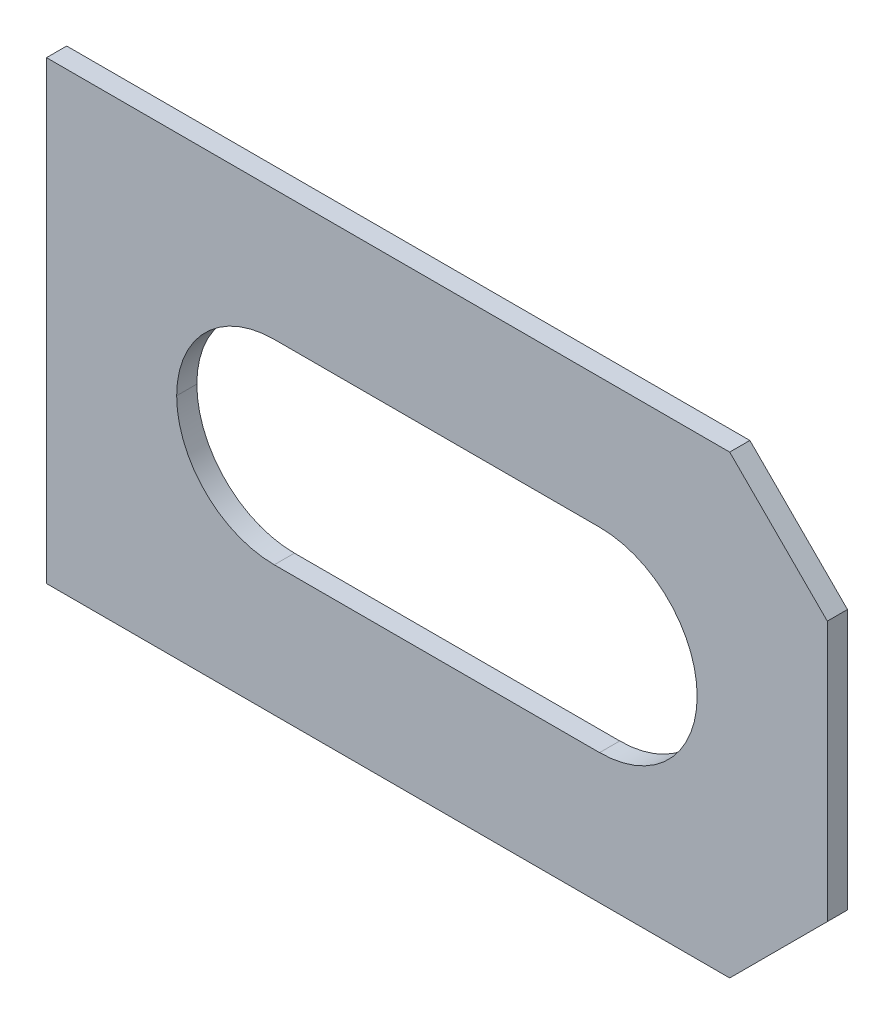
ISO-10303-21;
HEADER;
FILE_DESCRIPTION(('STEP AP214'),'2;1');
FILE_NAME('part.step','',(''),(''),'','','');
FILE_SCHEMA(('AUTOMOTIVE_DESIGN { 1 0 10303 214 1 1 1 1 }'));
ENDSEC;
DATA;
#1=APPLICATION_CONTEXT('core data for automotive mechanical design processes');
#2=APPLICATION_PROTOCOL_DEFINITION('international standard','automotive_design',2000,#1);
#3=PRODUCT_CONTEXT('',#1,'mechanical');
#4=PRODUCT('Part','Part','',(#3));
#5=PRODUCT_RELATED_PRODUCT_CATEGORY('part','',(#4));
#6=PRODUCT_DEFINITION_FORMATION('','',#4);
#7=PRODUCT_DEFINITION_CONTEXT('part definition',#1,'design');
#8=PRODUCT_DEFINITION('design','',#6,#7);
#9=PRODUCT_DEFINITION_SHAPE('','',#8);
#10=(LENGTH_UNIT() NAMED_UNIT(*) SI_UNIT(.MILLI.,.METRE.));
#11=(NAMED_UNIT(*) PLANE_ANGLE_UNIT() SI_UNIT($,.RADIAN.));
#12=(NAMED_UNIT(*) SI_UNIT($,.STERADIAN.) SOLID_ANGLE_UNIT());
#13=UNCERTAINTY_MEASURE_WITH_UNIT(LENGTH_MEASURE(1.E-05),#10,'distance_accuracy_value','');
#14=(GEOMETRIC_REPRESENTATION_CONTEXT(3) GLOBAL_UNCERTAINTY_ASSIGNED_CONTEXT((#13)) GLOBAL_UNIT_ASSIGNED_CONTEXT((#10,
#11,#12)) REPRESENTATION_CONTEXT('',''));
#15=CARTESIAN_POINT('',(0.,0.,0.));
#16=DIRECTION('',(0.,0.,1.));
#17=DIRECTION('',(1.,0.,0.));
#18=AXIS2_PLACEMENT_3D('',#15,#16,#17);
#19=CARTESIAN_POINT('',(0.,0.,3.1));
#20=DIRECTION('',(0.,0.,-1.));
#21=DIRECTION('',(-1.,0.,0.));
#22=AXIS2_PLACEMENT_3D('',#19,#20,#21);
#23=PLANE('',#22);
#24=DIRECTION('',(1.,0.,0.));
#25=VECTOR('',#24,1.);
#26=CARTESIAN_POINT('',(-60.,-35.,3.1));
#27=LINE('',#26,#25);
#28=CARTESIAN_POINT('',(-60.,-35.,3.1));
#29=VERTEX_POINT('',#28);
#30=CARTESIAN_POINT('',(44.9999999999999,-35.,3.1));
#31=VERTEX_POINT('',#30);
#32=EDGE_CURVE('E144',#29,#31,#27,.T.);
#33=ORIENTED_EDGE('',*,*,#32,.T.);
#34=DIRECTION('',(-0.707106781186549,-0.707106781186546,0.));
#35=VECTOR('',#34,1.);
#36=CARTESIAN_POINT('',(60.,-20.,3.1));
#37=LINE('',#36,#35);
#38=CARTESIAN_POINT('',(60.,-20.,3.1));
#39=VERTEX_POINT('',#38);
#40=EDGE_CURVE('E41',#31,#39,#37,.F.);
#41=ORIENTED_EDGE('',*,*,#40,.T.);
#42=DIRECTION('',(0.,1.,0.));
#43=VECTOR('',#42,1.);
#44=CARTESIAN_POINT('',(60.,-35.,3.1));
#45=LINE('',#44,#43);
#46=CARTESIAN_POINT('',(60.,20.,3.1));
#47=VERTEX_POINT('',#46);
#48=EDGE_CURVE('E130',#39,#47,#45,.T.);
#49=ORIENTED_EDGE('',*,*,#48,.T.);
#50=DIRECTION('',(0.707106781186546,-0.707106781186549,0.));
#51=VECTOR('',#50,1.);
#52=CARTESIAN_POINT('',(45.,35.,3.1));
#53=LINE('',#52,#51);
#54=CARTESIAN_POINT('',(45.,35.,3.1));
#55=VERTEX_POINT('',#54);
#56=EDGE_CURVE('E48',#47,#55,#53,.F.);
#57=ORIENTED_EDGE('',*,*,#56,.T.);
#58=DIRECTION('',(-1.,0.,0.));
#59=VECTOR('',#58,1.);
#60=CARTESIAN_POINT('',(-60.,35.,3.1));
#61=LINE('',#60,#59);
#62=CARTESIAN_POINT('',(-60.,35.,3.1));
#63=VERTEX_POINT('',#62);
#64=EDGE_CURVE('E122',#55,#63,#61,.T.);
#65=ORIENTED_EDGE('',*,*,#64,.T.);
#66=DIRECTION('',(0.,-1.,0.));
#67=VECTOR('',#66,1.);
#68=CARTESIAN_POINT('',(-60.,-35.,3.1));
#69=LINE('',#68,#67);
#70=EDGE_CURVE('E126',#63,#29,#69,.T.);
#71=ORIENTED_EDGE('',*,*,#70,.T.);
#72=EDGE_LOOP('',(#33,#41,#49,#57,#65,#71));
#73=FACE_BOUND('',#72,.T.);
#74=DIRECTION('',(-1.,0.,0.));
#75=VECTOR('',#74,1.);
#76=CARTESIAN_POINT('',(-40.,15.,3.1));
#77=LINE('',#76,#75);
#78=CARTESIAN_POINT('',(25.,15.,3.1));
#79=VERTEX_POINT('',#78);
#80=CARTESIAN_POINT('',(-25.,15.,3.1));
#81=VERTEX_POINT('',#80);
#82=EDGE_CURVE('E252',#79,#81,#77,.T.);
#83=ORIENTED_EDGE('',*,*,#82,.F.);
#84=CARTESIAN_POINT('',(25.,0.,3.1));
#85=DIRECTION('',(0.,0.,-1.));
#86=DIRECTION('',(-1.,0.,0.));
#87=AXIS2_PLACEMENT_3D('',#84,#85,#86);
#88=CIRCLE('',#87,15.);
#89=CARTESIAN_POINT('',(40.,0.,3.1));
#90=VERTEX_POINT('',#89);
#91=EDGE_CURVE('E174',#79,#90,#88,.T.);
#92=ORIENTED_EDGE('',*,*,#91,.T.);
#93=CARTESIAN_POINT('',(25.,0.,3.1));
#94=DIRECTION('',(0.,0.,-1.));
#95=DIRECTION('',(-1.,0.,0.));
#96=AXIS2_PLACEMENT_3D('',#93,#94,#95);
#97=CIRCLE('',#96,15.);
#98=CARTESIAN_POINT('',(25.,-15.,3.1));
#99=VERTEX_POINT('',#98);
#100=EDGE_CURVE('E170',#90,#99,#97,.T.);
#101=ORIENTED_EDGE('',*,*,#100,.T.);
#102=DIRECTION('',(1.,0.,0.));
#103=VECTOR('',#102,1.);
#104=CARTESIAN_POINT('',(-40.,-15.,3.1));
#105=LINE('',#104,#103);
#106=CARTESIAN_POINT('',(-25.,-15.,3.1));
#107=VERTEX_POINT('',#106);
#108=EDGE_CURVE('E152',#107,#99,#105,.T.);
#109=ORIENTED_EDGE('',*,*,#108,.F.);
#110=CARTESIAN_POINT('',(-25.,0.,3.1));
#111=DIRECTION('',(0.,0.,-1.));
#112=DIRECTION('',(-1.,0.,0.));
#113=AXIS2_PLACEMENT_3D('',#110,#111,#112);
#114=CIRCLE('',#113,15.);
#115=CARTESIAN_POINT('',(-40.,0.,3.1));
#116=VERTEX_POINT('',#115);
#117=EDGE_CURVE('E182',#107,#116,#114,.T.);
#118=ORIENTED_EDGE('',*,*,#117,.T.);
#119=CARTESIAN_POINT('',(-25.,0.,3.1));
#120=DIRECTION('',(0.,0.,-1.));
#121=DIRECTION('',(-1.,0.,0.));
#122=AXIS2_PLACEMENT_3D('',#119,#120,#121);
#123=CIRCLE('',#122,15.);
#124=EDGE_CURVE('E178',#116,#81,#123,.T.);
#125=ORIENTED_EDGE('',*,*,#124,.T.);
#126=EDGE_LOOP('',(#83,#92,#101,#109,#118,#125));
#127=FACE_BOUND('',#126,.T.);
#128=ADVANCED_FACE('F33',(#73,#127),#23,.F.);
#129=CARTESIAN_POINT('',(0.,0.,0.));
#130=DIRECTION('',(0.,0.,-1.));
#131=DIRECTION('',(-1.,0.,0.));
#132=AXIS2_PLACEMENT_3D('',#129,#130,#131);
#133=PLANE('',#132);
#134=DIRECTION('',(0.,1.,0.));
#135=VECTOR('',#134,1.);
#136=CARTESIAN_POINT('',(60.,-35.,0.));
#137=LINE('',#136,#135);
#138=CARTESIAN_POINT('',(60.,-20.,0.));
#139=VERTEX_POINT('',#138);
#140=CARTESIAN_POINT('',(60.,19.9999999999999,0.));
#141=VERTEX_POINT('',#140);
#142=EDGE_CURVE('E149',#139,#141,#137,.T.);
#143=ORIENTED_EDGE('',*,*,#142,.F.);
#144=DIRECTION('',(0.707106781186549,0.707106781186546,0.));
#145=VECTOR('',#144,1.);
#146=CARTESIAN_POINT('',(39.9999999999999,-40.,0.));
#147=LINE('',#146,#145);
#148=CARTESIAN_POINT('',(45.,-35.,0.));
#149=VERTEX_POINT('',#148);
#150=EDGE_CURVE('E198',#139,#149,#147,.F.);
#151=ORIENTED_EDGE('',*,*,#150,.T.);
#152=DIRECTION('',(1.,0.,0.));
#153=VECTOR('',#152,1.);
#154=CARTESIAN_POINT('',(-60.,-35.,0.));
#155=LINE('',#154,#153);
#156=CARTESIAN_POINT('',(-60.,-35.,0.));
#157=VERTEX_POINT('',#156);
#158=EDGE_CURVE('E156',#157,#149,#155,.T.);
#159=ORIENTED_EDGE('',*,*,#158,.F.);
#160=DIRECTION('',(0.,-1.,0.));
#161=VECTOR('',#160,1.);
#162=CARTESIAN_POINT('',(-60.,-35.,0.));
#163=LINE('',#162,#161);
#164=CARTESIAN_POINT('',(-60.,35.,0.));
#165=VERTEX_POINT('',#164);
#166=EDGE_CURVE('E154',#165,#157,#163,.T.);
#167=ORIENTED_EDGE('',*,*,#166,.F.);
#168=DIRECTION('',(-1.,0.,0.));
#169=VECTOR('',#168,1.);
#170=CARTESIAN_POINT('',(-60.,35.,0.));
#171=LINE('',#170,#169);
#172=CARTESIAN_POINT('',(45.,35.,0.));
#173=VERTEX_POINT('',#172);
#174=EDGE_CURVE('E136',#173,#165,#171,.T.);
#175=ORIENTED_EDGE('',*,*,#174,.F.);
#176=DIRECTION('',(-0.707106781186546,0.707106781186549,0.));
#177=VECTOR('',#176,1.);
#178=CARTESIAN_POINT('',(40.0000000000001,39.9999999999999,0.));
#179=LINE('',#178,#177);
#180=EDGE_CURVE('E196',#173,#141,#179,.F.);
#181=ORIENTED_EDGE('',*,*,#180,.T.);
#182=EDGE_LOOP('',(#143,#151,#159,#167,#175,#181));
#183=FACE_BOUND('',#182,.T.);
#184=CARTESIAN_POINT('',(-25.,0.,0.));
#185=DIRECTION('',(0.,0.,-1.));
#186=DIRECTION('',(-1.,0.,0.));
#187=AXIS2_PLACEMENT_3D('',#184,#185,#186);
#188=CIRCLE('',#187,15.);
#189=CARTESIAN_POINT('',(-25.,15.,0.));
#190=VERTEX_POINT('',#189);
#191=CARTESIAN_POINT('',(-40.,0.,0.));
#192=VERTEX_POINT('',#191);
#193=EDGE_CURVE('E176',#190,#192,#188,.F.);
#194=ORIENTED_EDGE('',*,*,#193,.T.);
#195=CARTESIAN_POINT('',(-25.,0.,0.));
#196=DIRECTION('',(0.,0.,-1.));
#197=DIRECTION('',(-1.,0.,0.));
#198=AXIS2_PLACEMENT_3D('',#195,#196,#197);
#199=CIRCLE('',#198,15.);
#200=CARTESIAN_POINT('',(-25.,-15.,0.));
#201=VERTEX_POINT('',#200);
#202=EDGE_CURVE('E180',#192,#201,#199,.F.);
#203=ORIENTED_EDGE('',*,*,#202,.T.);
#204=DIRECTION('',(1.,0.,0.));
#205=VECTOR('',#204,1.);
#206=CARTESIAN_POINT('',(-40.,-15.,0.));
#207=LINE('',#206,#205);
#208=CARTESIAN_POINT('',(25.,-15.,0.));
#209=VERTEX_POINT('',#208);
#210=EDGE_CURVE('E260',#201,#209,#207,.T.);
#211=ORIENTED_EDGE('',*,*,#210,.T.);
#212=CARTESIAN_POINT('',(25.,0.,0.));
#213=DIRECTION('',(0.,0.,-1.));
#214=DIRECTION('',(-1.,0.,0.));
#215=AXIS2_PLACEMENT_3D('',#212,#213,#214);
#216=CIRCLE('',#215,15.);
#217=CARTESIAN_POINT('',(40.,0.,0.));
#218=VERTEX_POINT('',#217);
#219=EDGE_CURVE('E168',#209,#218,#216,.F.);
#220=ORIENTED_EDGE('',*,*,#219,.T.);
#221=CARTESIAN_POINT('',(25.,0.,0.));
#222=DIRECTION('',(0.,0.,-1.));
#223=DIRECTION('',(-1.,0.,0.));
#224=AXIS2_PLACEMENT_3D('',#221,#222,#223);
#225=CIRCLE('',#224,15.);
#226=CARTESIAN_POINT('',(25.,15.,0.));
#227=VERTEX_POINT('',#226);
#228=EDGE_CURVE('E172',#218,#227,#225,.F.);
#229=ORIENTED_EDGE('',*,*,#228,.T.);
#230=DIRECTION('',(-1.,0.,0.));
#231=VECTOR('',#230,1.);
#232=CARTESIAN_POINT('',(-40.,15.,0.));
#233=LINE('',#232,#231);
#234=EDGE_CURVE('E188',#227,#190,#233,.T.);
#235=ORIENTED_EDGE('',*,*,#234,.T.);
#236=EDGE_LOOP('',(#194,#203,#211,#220,#229,#235));
#237=FACE_BOUND('',#236,.T.);
#238=ADVANCED_FACE('F212',(#183,#237),#133,.T.);
#239=CARTESIAN_POINT('',(60.,-35.,3.1));
#240=DIRECTION('',(-1.,0.,0.));
#241=DIRECTION('',(0.,0.,1.));
#242=AXIS2_PLACEMENT_3D('',#239,#240,#241);
#243=PLANE('',#242);
#244=ORIENTED_EDGE('',*,*,#48,.F.);
#245=DIRECTION('',(0.,0.,-1.));
#246=VECTOR('',#245,1.);
#247=CARTESIAN_POINT('',(60.,-20.,3.1));
#248=LINE('',#247,#246);
#249=EDGE_CURVE('E193',#39,#139,#248,.T.);
#250=ORIENTED_EDGE('',*,*,#249,.T.);
#251=ORIENTED_EDGE('',*,*,#142,.T.);
#252=DIRECTION('',(0.,0.,1.));
#253=VECTOR('',#252,1.);
#254=CARTESIAN_POINT('',(60.,19.9999999999999,3.1));
#255=LINE('',#254,#253);
#256=EDGE_CURVE('E184',#141,#47,#255,.T.);
#257=ORIENTED_EDGE('',*,*,#256,.T.);
#258=EDGE_LOOP('',(#244,#250,#251,#257));
#259=FACE_BOUND('',#258,.T.);
#260=ADVANCED_FACE('F206',(#259),#243,.F.);
#261=CARTESIAN_POINT('',(-60.,35.,3.1));
#262=DIRECTION('',(0.,-1.,0.));
#263=DIRECTION('',(0.,0.,-1.));
#264=AXIS2_PLACEMENT_3D('',#261,#262,#263);
#265=PLANE('',#264);
#266=ORIENTED_EDGE('',*,*,#64,.F.);
#267=DIRECTION('',(0.,0.,-1.));
#268=VECTOR('',#267,1.);
#269=CARTESIAN_POINT('',(45.,35.,3.1));
#270=LINE('',#269,#268);
#271=EDGE_CURVE('E11',#55,#173,#270,.T.);
#272=ORIENTED_EDGE('',*,*,#271,.T.);
#273=ORIENTED_EDGE('',*,*,#174,.T.);
#274=DIRECTION('',(0.,0.,-1.));
#275=VECTOR('',#274,1.);
#276=CARTESIAN_POINT('',(-60.,35.,3.1));
#277=LINE('',#276,#275);
#278=EDGE_CURVE('E133',#63,#165,#277,.T.);
#279=ORIENTED_EDGE('',*,*,#278,.F.);
#280=EDGE_LOOP('',(#266,#272,#273,#279));
#281=FACE_BOUND('',#280,.T.);
#282=ADVANCED_FACE('F134',(#281),#265,.F.);
#283=CARTESIAN_POINT('',(-60.,-35.,3.1));
#284=DIRECTION('',(1.,0.,0.));
#285=DIRECTION('',(0.,0.,-1.));
#286=AXIS2_PLACEMENT_3D('',#283,#284,#285);
#287=PLANE('',#286);
#288=ORIENTED_EDGE('',*,*,#166,.T.);
#289=DIRECTION('',(0.,0.,-1.));
#290=VECTOR('',#289,1.);
#291=CARTESIAN_POINT('',(-60.,-35.,3.1));
#292=LINE('',#291,#290);
#293=EDGE_CURVE('E140',#29,#157,#292,.T.);
#294=ORIENTED_EDGE('',*,*,#293,.F.);
#295=ORIENTED_EDGE('',*,*,#70,.F.);
#296=ORIENTED_EDGE('',*,*,#278,.T.);
#297=EDGE_LOOP('',(#288,#294,#295,#296));
#298=FACE_BOUND('',#297,.T.);
#299=ADVANCED_FACE('F142',(#298),#287,.F.);
#300=CARTESIAN_POINT('',(-60.,-35.,3.1));
#301=DIRECTION('',(0.,1.,0.));
#302=DIRECTION('',(0.,0.,1.));
#303=AXIS2_PLACEMENT_3D('',#300,#301,#302);
#304=PLANE('',#303);
#305=ORIENTED_EDGE('',*,*,#158,.T.);
#306=DIRECTION('',(0.,0.,1.));
#307=VECTOR('',#306,1.);
#308=CARTESIAN_POINT('',(45.,-35.,3.1));
#309=LINE('',#308,#307);
#310=EDGE_CURVE('E56',#149,#31,#309,.T.);
#311=ORIENTED_EDGE('',*,*,#310,.T.);
#312=ORIENTED_EDGE('',*,*,#32,.F.);
#313=ORIENTED_EDGE('',*,*,#293,.T.);
#314=EDGE_LOOP('',(#305,#311,#312,#313));
#315=FACE_BOUND('',#314,.T.);
#316=ADVANCED_FACE('F214',(#315),#304,.F.);
#317=CARTESIAN_POINT('',(-40.,15.,3.1));
#318=DIRECTION('',(0.,-1.,0.));
#319=DIRECTION('',(0.,0.,-1.));
#320=AXIS2_PLACEMENT_3D('',#317,#318,#319);
#321=PLANE('',#320);
#322=ORIENTED_EDGE('',*,*,#234,.F.);
#323=DIRECTION('',(0.,0.,-1.));
#324=VECTOR('',#323,1.);
#325=CARTESIAN_POINT('',(25.,15.,3.1));
#326=LINE('',#325,#324);
#327=EDGE_CURVE('E166',#227,#79,#326,.F.);
#328=ORIENTED_EDGE('',*,*,#327,.T.);
#329=ORIENTED_EDGE('',*,*,#82,.T.);
#330=DIRECTION('',(0.,0.,-1.));
#331=VECTOR('',#330,1.);
#332=CARTESIAN_POINT('',(-25.,15.,0.));
#333=LINE('',#332,#331);
#334=EDGE_CURVE('E163',#81,#190,#333,.T.);
#335=ORIENTED_EDGE('',*,*,#334,.T.);
#336=EDGE_LOOP('',(#322,#328,#329,#335));
#337=FACE_BOUND('',#336,.T.);
#338=ADVANCED_FACE('F216',(#337),#321,.T.);
#339=CARTESIAN_POINT('',(-40.,-15.,3.1));
#340=DIRECTION('',(0.,1.,0.));
#341=DIRECTION('',(0.,0.,1.));
#342=AXIS2_PLACEMENT_3D('',#339,#340,#341);
#343=PLANE('',#342);
#344=ORIENTED_EDGE('',*,*,#108,.T.);
#345=DIRECTION('',(0.,0.,-1.));
#346=VECTOR('',#345,1.);
#347=CARTESIAN_POINT('',(25.,-15.,0.));
#348=LINE('',#347,#346);
#349=EDGE_CURVE('E160',#99,#209,#348,.T.);
#350=ORIENTED_EDGE('',*,*,#349,.T.);
#351=ORIENTED_EDGE('',*,*,#210,.F.);
#352=DIRECTION('',(0.,0.,-1.));
#353=VECTOR('',#352,1.);
#354=CARTESIAN_POINT('',(-25.,-15.,3.1));
#355=LINE('',#354,#353);
#356=EDGE_CURVE('E139',#201,#107,#355,.F.);
#357=ORIENTED_EDGE('',*,*,#356,.T.);
#358=EDGE_LOOP('',(#344,#350,#351,#357));
#359=FACE_BOUND('',#358,.T.);
#360=ADVANCED_FACE('F223',(#359),#343,.T.);
#361=CARTESIAN_POINT('',(25.,0.,3.1));
#362=DIRECTION('',(0.,0.,1.));
#363=DIRECTION('',(1.,0.,0.));
#364=AXIS2_PLACEMENT_3D('',#361,#362,#363);
#365=CYLINDRICAL_SURFACE('',#364,15.);
#366=DIRECTION('',(0.,0.,-1.));
#367=VECTOR('',#366,1.);
#368=CARTESIAN_POINT('',(40.,0.,0.));
#369=LINE('',#368,#367);
#370=EDGE_CURVE('E185',#90,#218,#369,.T.);
#371=ORIENTED_EDGE('',*,*,#370,.F.);
#372=ORIENTED_EDGE('',*,*,#91,.F.);
#373=ORIENTED_EDGE('',*,*,#327,.F.);
#374=ORIENTED_EDGE('',*,*,#228,.F.);
#375=EDGE_LOOP('',(#371,#372,#373,#374));
#376=FACE_BOUND('',#375,.T.);
#377=ADVANCED_FACE('F237',(#376),#365,.F.);
#378=CARTESIAN_POINT('',(25.,0.,3.1));
#379=DIRECTION('',(0.,0.,1.));
#380=DIRECTION('',(1.,0.,0.));
#381=AXIS2_PLACEMENT_3D('',#378,#379,#380);
#382=CYLINDRICAL_SURFACE('',#381,15.);
#383=ORIENTED_EDGE('',*,*,#100,.F.);
#384=ORIENTED_EDGE('',*,*,#370,.T.);
#385=ORIENTED_EDGE('',*,*,#219,.F.);
#386=ORIENTED_EDGE('',*,*,#349,.F.);
#387=EDGE_LOOP('',(#383,#384,#385,#386));
#388=FACE_BOUND('',#387,.T.);
#389=ADVANCED_FACE('F242',(#388),#382,.F.);
#390=CARTESIAN_POINT('',(-25.,0.,3.1));
#391=DIRECTION('',(0.,0.,1.));
#392=DIRECTION('',(1.,0.,0.));
#393=AXIS2_PLACEMENT_3D('',#390,#391,#392);
#394=CYLINDRICAL_SURFACE('',#393,15.);
#395=DIRECTION('',(0.,0.,-1.));
#396=VECTOR('',#395,1.);
#397=CARTESIAN_POINT('',(-40.,0.,0.));
#398=LINE('',#397,#396);
#399=EDGE_CURVE('E189',#116,#192,#398,.T.);
#400=ORIENTED_EDGE('',*,*,#399,.F.);
#401=ORIENTED_EDGE('',*,*,#117,.F.);
#402=ORIENTED_EDGE('',*,*,#356,.F.);
#403=ORIENTED_EDGE('',*,*,#202,.F.);
#404=EDGE_LOOP('',(#400,#401,#402,#403));
#405=FACE_BOUND('',#404,.T.);
#406=ADVANCED_FACE('F274',(#405),#394,.F.);
#407=CARTESIAN_POINT('',(-25.,0.,3.1));
#408=DIRECTION('',(0.,0.,1.));
#409=DIRECTION('',(1.,0.,0.));
#410=AXIS2_PLACEMENT_3D('',#407,#408,#409);
#411=CYLINDRICAL_SURFACE('',#410,15.);
#412=ORIENTED_EDGE('',*,*,#124,.F.);
#413=ORIENTED_EDGE('',*,*,#399,.T.);
#414=ORIENTED_EDGE('',*,*,#193,.F.);
#415=ORIENTED_EDGE('',*,*,#334,.F.);
#416=EDGE_LOOP('',(#412,#413,#414,#415));
#417=FACE_BOUND('',#416,.T.);
#418=ADVANCED_FACE('F275',(#417),#411,.F.);
#419=CARTESIAN_POINT('',(60.,-20.,3.1));
#420=DIRECTION('',(-0.707106781186546,0.707106781186549,0.));
#421=DIRECTION('',(0.,0.,-1.));
#422=AXIS2_PLACEMENT_3D('',#419,#420,#421);
#423=PLANE('',#422);
#424=ORIENTED_EDGE('',*,*,#40,.F.);
#425=ORIENTED_EDGE('',*,*,#310,.F.);
#426=ORIENTED_EDGE('',*,*,#150,.F.);
#427=ORIENTED_EDGE('',*,*,#249,.F.);
#428=EDGE_LOOP('',(#424,#425,#426,#427));
#429=FACE_BOUND('',#428,.T.);
#430=ADVANCED_FACE('F209',(#429),#423,.F.);
#431=CARTESIAN_POINT('',(45.,35.,3.1));
#432=DIRECTION('',(-0.707106781186549,-0.707106781186546,0.));
#433=DIRECTION('',(0.,0.,-1.));
#434=AXIS2_PLACEMENT_3D('',#431,#432,#433);
#435=PLANE('',#434);
#436=ORIENTED_EDGE('',*,*,#56,.F.);
#437=ORIENTED_EDGE('',*,*,#256,.F.);
#438=ORIENTED_EDGE('',*,*,#180,.F.);
#439=ORIENTED_EDGE('',*,*,#271,.F.);
#440=EDGE_LOOP('',(#436,#437,#438,#439));
#441=FACE_BOUND('',#440,.T.);
#442=ADVANCED_FACE('F35',(#441),#435,.F.);
#443=CLOSED_SHELL('',(#128,#238,#260,#282,#299,#316,#338,#360,#377,#389,#406,#418,#430,#442));
#444=MANIFOLD_SOLID_BREP('B2',#443);
#445=ADVANCED_BREP_SHAPE_REPRESENTATION('',(#18,#444),#14);
#446=SHAPE_DEFINITION_REPRESENTATION(#9,#445);
ENDSEC;
END-ISO-10303-21;
